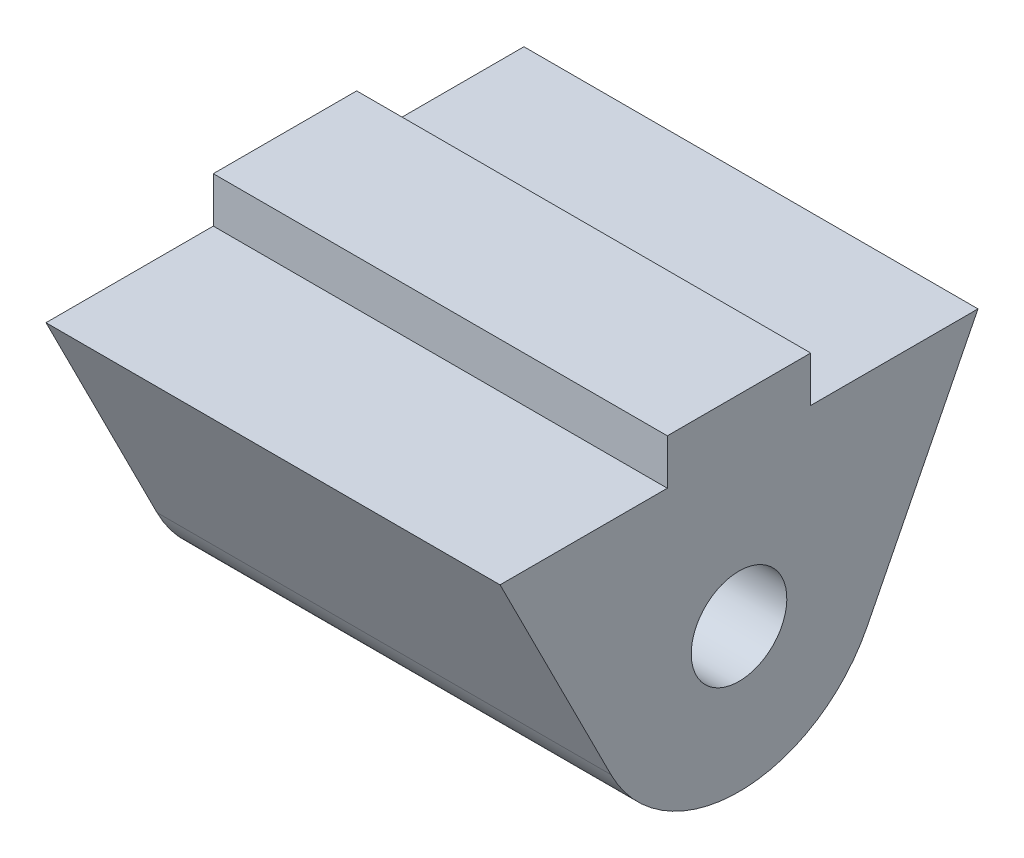
ISO-10303-21;
HEADER;
FILE_DESCRIPTION(('STEP AP214'),'2;1');
FILE_NAME('part.step','',(''),(''),'','','');
FILE_SCHEMA(('AUTOMOTIVE_DESIGN { 1 0 10303 214 1 1 1 1 }'));
ENDSEC;
DATA;
#1=APPLICATION_CONTEXT('core data for automotive mechanical design processes');
#2=APPLICATION_PROTOCOL_DEFINITION('international standard','automotive_design',2000,#1);
#3=PRODUCT_CONTEXT('',#1,'mechanical');
#4=PRODUCT('Part','Part','',(#3));
#5=PRODUCT_RELATED_PRODUCT_CATEGORY('part','',(#4));
#6=PRODUCT_DEFINITION_FORMATION('','',#4);
#7=PRODUCT_DEFINITION_CONTEXT('part definition',#1,'design');
#8=PRODUCT_DEFINITION('design','',#6,#7);
#9=PRODUCT_DEFINITION_SHAPE('','',#8);
#10=(LENGTH_UNIT() NAMED_UNIT(*) SI_UNIT(.MILLI.,.METRE.));
#11=(NAMED_UNIT(*) PLANE_ANGLE_UNIT() SI_UNIT($,.RADIAN.));
#12=(NAMED_UNIT(*) SI_UNIT($,.STERADIAN.) SOLID_ANGLE_UNIT());
#13=UNCERTAINTY_MEASURE_WITH_UNIT(LENGTH_MEASURE(1.E-05),#10,'distance_accuracy_value','');
#14=(GEOMETRIC_REPRESENTATION_CONTEXT(3) GLOBAL_UNCERTAINTY_ASSIGNED_CONTEXT((#13)) GLOBAL_UNIT_ASSIGNED_CONTEXT((#10,
#11,#12)) REPRESENTATION_CONTEXT('',''));
#15=CARTESIAN_POINT('',(0.,0.,0.));
#16=DIRECTION('',(0.,0.,1.));
#17=DIRECTION('',(1.,0.,0.));
#18=AXIS2_PLACEMENT_3D('',#15,#16,#17);
#19=CARTESIAN_POINT('',(0.,6.5,0.));
#20=DIRECTION('',(0.,-1.,0.));
#21=DIRECTION('',(0.,0.,-1.));
#22=AXIS2_PLACEMENT_3D('',#19,#20,#21);
#23=PLANE('',#22);
#24=DIRECTION('',(1.,0.,0.));
#25=VECTOR('',#24,1.);
#26=CARTESIAN_POINT('',(-9.5,6.5,3.));
#27=LINE('',#26,#25);
#28=CARTESIAN_POINT('',(-9.5,6.5,3.));
#29=VERTEX_POINT('',#28);
#30=CARTESIAN_POINT('',(9.5,6.5,3.));
#31=VERTEX_POINT('',#30);
#32=EDGE_CURVE('E61',#29,#31,#27,.T.);
#33=ORIENTED_EDGE('',*,*,#32,.F.);
#34=DIRECTION('',(0.,0.,-1.));
#35=VECTOR('',#34,1.);
#36=CARTESIAN_POINT('',(-9.5,6.5,0.));
#37=LINE('',#36,#35);
#38=CARTESIAN_POINT('',(-9.5,6.5,10.));
#39=VERTEX_POINT('',#38);
#40=EDGE_CURVE('E116',#39,#29,#37,.T.);
#41=ORIENTED_EDGE('',*,*,#40,.F.);
#42=DIRECTION('',(1.,0.,0.));
#43=VECTOR('',#42,1.);
#44=CARTESIAN_POINT('',(-33.0849528301415,6.5,10.));
#45=LINE('',#44,#43);
#46=CARTESIAN_POINT('',(9.5,6.5,10.));
#47=VERTEX_POINT('',#46);
#48=EDGE_CURVE('E162',#39,#47,#45,.T.);
#49=ORIENTED_EDGE('',*,*,#48,.T.);
#50=DIRECTION('',(0.,0.,-1.));
#51=VECTOR('',#50,1.);
#52=CARTESIAN_POINT('',(9.5,6.5,0.));
#53=LINE('',#52,#51);
#54=EDGE_CURVE('E48',#47,#31,#53,.T.);
#55=ORIENTED_EDGE('',*,*,#54,.T.);
#56=EDGE_LOOP('',(#33,#41,#49,#55));
#57=FACE_BOUND('',#56,.T.);
#58=ADVANCED_FACE('F45',(#57),#23,.F.);
#59=DIRECTION('',(-1.,0.,0.));
#60=VECTOR('',#59,1.);
#61=CARTESIAN_POINT('',(-9.5,6.5,-3.));
#62=LINE('',#61,#60);
#63=CARTESIAN_POINT('',(9.5,6.5,-3.));
#64=VERTEX_POINT('',#63);
#65=CARTESIAN_POINT('',(-9.5,6.5,-3.));
#66=VERTEX_POINT('',#65);
#67=EDGE_CURVE('E69',#64,#66,#62,.T.);
#68=ORIENTED_EDGE('',*,*,#67,.F.);
#69=CARTESIAN_POINT('',(9.5,6.5,-9.99999999999999));
#70=VERTEX_POINT('',#69);
#71=EDGE_CURVE('E143',#64,#70,#53,.T.);
#72=ORIENTED_EDGE('',*,*,#71,.T.);
#73=DIRECTION('',(1.,0.,0.));
#74=VECTOR('',#73,1.);
#75=CARTESIAN_POINT('',(-33.0849528301415,6.5,-10.));
#76=LINE('',#75,#74);
#77=CARTESIAN_POINT('',(-9.5,6.5,-10.));
#78=VERTEX_POINT('',#77);
#79=EDGE_CURVE('E112',#78,#70,#76,.T.);
#80=ORIENTED_EDGE('',*,*,#79,.F.);
#81=EDGE_CURVE('E109',#66,#78,#37,.T.);
#82=ORIENTED_EDGE('',*,*,#81,.F.);
#83=EDGE_LOOP('',(#68,#72,#80,#82));
#84=FACE_BOUND('',#83,.T.);
#85=ADVANCED_FACE('F110',(#84),#23,.F.);
#86=CARTESIAN_POINT('',(-33.0849528301415,-2.70274758413108,-5.3567859296856));
#87=DIRECTION('',(0.,-0.450457930688488,-0.892797654947551));
#88=DIRECTION('',(0.,0.892797654947551,-0.450457930688488));
#89=AXIS2_PLACEMENT_3D('',#86,#87,#88);
#90=PLANE('',#89);
#91=DIRECTION('',(1.,0.,0.));
#92=VECTOR('',#91,1.);
#93=CARTESIAN_POINT('',(-33.0849528301415,-2.70274758413071,-5.3567859296856));
#94=LINE('',#93,#92);
#95=CARTESIAN_POINT('',(-9.5,-2.70274758413079,-5.35678592968575));
#96=VERTEX_POINT('',#95);
#97=CARTESIAN_POINT('',(9.5,-2.70274758413079,-5.35678592968575));
#98=VERTEX_POINT('',#97);
#99=EDGE_CURVE('E155',#96,#98,#94,.T.);
#100=ORIENTED_EDGE('',*,*,#99,.F.);
#101=DIRECTION('',(0.,0.892797654947551,-0.450457930688488));
#102=VECTOR('',#101,1.);
#103=CARTESIAN_POINT('',(-9.5,-2.70274758413108,-5.3567859296856));
#104=LINE('',#103,#102);
#105=EDGE_CURVE('E151',#96,#78,#104,.T.);
#106=ORIENTED_EDGE('',*,*,#105,.T.);
#107=ORIENTED_EDGE('',*,*,#79,.T.);
#108=DIRECTION('',(0.,0.892797654947551,-0.450457930688488));
#109=VECTOR('',#108,1.);
#110=CARTESIAN_POINT('',(9.5,-2.70274758413108,-5.3567859296856));
#111=LINE('',#110,#109);
#112=EDGE_CURVE('E11',#98,#70,#111,.T.);
#113=ORIENTED_EDGE('',*,*,#112,.F.);
#114=EDGE_LOOP('',(#100,#106,#107,#113));
#115=FACE_BOUND('',#114,.T.);
#116=ADVANCED_FACE('F181',(#115),#90,.T.);
#117=CARTESIAN_POINT('',(-33.0849528301415,0.,0.));
#118=DIRECTION('',(1.,0.,0.));
#119=DIRECTION('',(0.,0.,-1.));
#120=AXIS2_PLACEMENT_3D('',#117,#118,#119);
#121=CYLINDRICAL_SURFACE('',#120,6.);
#122=DIRECTION('',(1.,0.,0.));
#123=VECTOR('',#122,1.);
#124=CARTESIAN_POINT('',(-33.0849528301415,-2.70274758413096,5.35678592968528));
#125=LINE('',#124,#123);
#126=CARTESIAN_POINT('',(-9.5,-2.70274758413096,5.35678592968528));
#127=VERTEX_POINT('',#126);
#128=CARTESIAN_POINT('',(9.5,-2.70274758413096,5.35678592968528));
#129=VERTEX_POINT('',#128);
#130=EDGE_CURVE('E153',#127,#129,#125,.T.);
#131=ORIENTED_EDGE('',*,*,#130,.F.);
#132=CARTESIAN_POINT('',(-9.5,0.,0.));
#133=DIRECTION('',(-1.,0.,0.));
#134=DIRECTION('',(0.,-1.,0.));
#135=AXIS2_PLACEMENT_3D('',#132,#133,#134);
#136=CIRCLE('',#135,6.);
#137=EDGE_CURVE('E157',#127,#96,#136,.F.);
#138=ORIENTED_EDGE('',*,*,#137,.T.);
#139=ORIENTED_EDGE('',*,*,#99,.T.);
#140=CARTESIAN_POINT('',(9.5,0.,0.));
#141=DIRECTION('',(1.,0.,0.));
#142=DIRECTION('',(0.,1.,0.));
#143=AXIS2_PLACEMENT_3D('',#140,#141,#142);
#144=CIRCLE('',#143,6.);
#145=EDGE_CURVE('E53',#129,#98,#144,.T.);
#146=ORIENTED_EDGE('',*,*,#145,.F.);
#147=EDGE_LOOP('',(#131,#138,#139,#146));
#148=FACE_BOUND('',#147,.T.);
#149=ADVANCED_FACE('F187',(#148),#121,.T.);
#150=CARTESIAN_POINT('',(-33.0849528301415,-2.7027475841311,5.35678592968521));
#151=DIRECTION('',(0.,0.450457930688517,-0.892797654947536));
#152=DIRECTION('',(0.,0.892797654947536,0.450457930688517));
#153=AXIS2_PLACEMENT_3D('',#150,#151,#152);
#154=PLANE('',#153);
#155=DIRECTION('',(0.,0.892797654947536,0.450457930688517));
#156=VECTOR('',#155,1.);
#157=CARTESIAN_POINT('',(-9.5,-2.7027475841311,5.35678592968521));
#158=LINE('',#157,#156);
#159=EDGE_CURVE('E117',#127,#39,#158,.T.);
#160=ORIENTED_EDGE('',*,*,#159,.F.);
#161=ORIENTED_EDGE('',*,*,#130,.T.);
#162=DIRECTION('',(0.,0.892797654947536,0.450457930688517));
#163=VECTOR('',#162,1.);
#164=CARTESIAN_POINT('',(9.5,-2.7027475841311,5.35678592968521));
#165=LINE('',#164,#163);
#166=EDGE_CURVE('E167',#129,#47,#165,.T.);
#167=ORIENTED_EDGE('',*,*,#166,.T.);
#168=ORIENTED_EDGE('',*,*,#48,.F.);
#169=EDGE_LOOP('',(#160,#161,#167,#168));
#170=FACE_BOUND('',#169,.T.);
#171=ADVANCED_FACE('F190',(#170),#154,.F.);
#172=CARTESIAN_POINT('',(-33.0849528301415,0.,0.));
#173=DIRECTION('',(1.,0.,0.));
#174=DIRECTION('',(0.,0.,-1.));
#175=AXIS2_PLACEMENT_3D('',#172,#173,#174);
#176=CYLINDRICAL_SURFACE('',#175,2.);
#177=CARTESIAN_POINT('',(-9.5,0.,0.));
#178=DIRECTION('',(-1.,0.,0.));
#179=DIRECTION('',(0.,-1.,0.));
#180=AXIS2_PLACEMENT_3D('',#177,#178,#179);
#181=CIRCLE('',#180,2.);
#182=CARTESIAN_POINT('',(-9.5,-2.,0.));
#183=VERTEX_POINT('',#182);
#184=EDGE_CURVE('E154',#183,#183,#181,.F.);
#185=ORIENTED_EDGE('',*,*,#184,.F.);
#186=EDGE_LOOP('',(#185));
#187=FACE_BOUND('',#186,.T.);
#188=CARTESIAN_POINT('',(9.5,0.,0.));
#189=DIRECTION('',(1.,0.,0.));
#190=DIRECTION('',(0.,1.,0.));
#191=AXIS2_PLACEMENT_3D('',#188,#189,#190);
#192=CIRCLE('',#191,2.);
#193=CARTESIAN_POINT('',(9.5,2.,0.));
#194=VERTEX_POINT('',#193);
#195=EDGE_CURVE('E170',#194,#194,#192,.T.);
#196=ORIENTED_EDGE('',*,*,#195,.T.);
#197=EDGE_LOOP('',(#196));
#198=FACE_BOUND('',#197,.T.);
#199=ADVANCED_FACE('F192',(#187,#198),#176,.F.);
#200=CARTESIAN_POINT('',(9.5,-139.999817401926,-0.226113748918073));
#201=DIRECTION('',(1.,0.,0.));
#202=DIRECTION('',(0.,0.00161509820655725,-0.999998695728041));
#203=AXIS2_PLACEMENT_3D('',#200,#201,#202);
#204=PLANE('',#203);
#205=ORIENTED_EDGE('',*,*,#195,.F.);
#206=EDGE_LOOP('',(#205));
#207=FACE_BOUND('',#206,.T.);
#208=ORIENTED_EDGE('',*,*,#166,.F.);
#209=ORIENTED_EDGE('',*,*,#145,.T.);
#210=ORIENTED_EDGE('',*,*,#112,.T.);
#211=ORIENTED_EDGE('',*,*,#71,.F.);
#212=DIRECTION('',(0.,-1.,0.));
#213=VECTOR('',#212,1.);
#214=CARTESIAN_POINT('',(9.5,8.4,-3.));
#215=LINE('',#214,#213);
#216=CARTESIAN_POINT('',(9.5,8.4,-3.));
#217=VERTEX_POINT('',#216);
#218=EDGE_CURVE('E127',#217,#64,#215,.T.);
#219=ORIENTED_EDGE('',*,*,#218,.F.);
#220=DIRECTION('',(0.,0.,-1.));
#221=VECTOR('',#220,1.);
#222=CARTESIAN_POINT('',(9.5,8.4,3.));
#223=LINE('',#222,#221);
#224=CARTESIAN_POINT('',(9.5,8.4,3.));
#225=VERTEX_POINT('',#224);
#226=EDGE_CURVE('E147',#225,#217,#223,.T.);
#227=ORIENTED_EDGE('',*,*,#226,.F.);
#228=DIRECTION('',(0.,-1.,0.));
#229=VECTOR('',#228,1.);
#230=CARTESIAN_POINT('',(9.5,8.4,3.));
#231=LINE('',#230,#229);
#232=EDGE_CURVE('E138',#225,#31,#231,.T.);
#233=ORIENTED_EDGE('',*,*,#232,.T.);
#234=ORIENTED_EDGE('',*,*,#54,.F.);
#235=EDGE_LOOP('',(#208,#209,#210,#211,#219,#227,#233,#234));
#236=FACE_BOUND('',#235,.T.);
#237=ADVANCED_FACE('F183',(#207,#236),#204,.T.);
#238=CARTESIAN_POINT('',(-9.5,-139.999817401926,-0.226113748918073));
#239=DIRECTION('',(-1.,0.,0.));
#240=DIRECTION('',(0.,0.00161509820655725,-0.999998695728041));
#241=AXIS2_PLACEMENT_3D('',#238,#239,#240);
#242=PLANE('',#241);
#243=ORIENTED_EDGE('',*,*,#137,.F.);
#244=ORIENTED_EDGE('',*,*,#159,.T.);
#245=ORIENTED_EDGE('',*,*,#40,.T.);
#246=DIRECTION('',(0.,-1.,0.));
#247=VECTOR('',#246,1.);
#248=CARTESIAN_POINT('',(-9.5,8.4,3.));
#249=LINE('',#248,#247);
#250=CARTESIAN_POINT('',(-9.5,8.4,3.));
#251=VERTEX_POINT('',#250);
#252=EDGE_CURVE('E134',#251,#29,#249,.T.);
#253=ORIENTED_EDGE('',*,*,#252,.F.);
#254=DIRECTION('',(0.,0.,1.));
#255=VECTOR('',#254,1.);
#256=CARTESIAN_POINT('',(-9.5,8.4,3.));
#257=LINE('',#256,#255);
#258=CARTESIAN_POINT('',(-9.5,8.4,-3.));
#259=VERTEX_POINT('',#258);
#260=EDGE_CURVE('E133',#259,#251,#257,.T.);
#261=ORIENTED_EDGE('',*,*,#260,.F.);
#262=DIRECTION('',(0.,-1.,0.));
#263=VECTOR('',#262,1.);
#264=CARTESIAN_POINT('',(-9.5,8.4,-3.));
#265=LINE('',#264,#263);
#266=EDGE_CURVE('E124',#259,#66,#265,.T.);
#267=ORIENTED_EDGE('',*,*,#266,.T.);
#268=ORIENTED_EDGE('',*,*,#81,.T.);
#269=ORIENTED_EDGE('',*,*,#105,.F.);
#270=EDGE_LOOP('',(#243,#244,#245,#253,#261,#267,#268,#269));
#271=FACE_BOUND('',#270,.T.);
#272=ORIENTED_EDGE('',*,*,#184,.T.);
#273=EDGE_LOOP('',(#272));
#274=FACE_BOUND('',#273,.T.);
#275=ADVANCED_FACE('F130',(#271,#274),#242,.T.);
#276=CARTESIAN_POINT('',(-9.5,8.4,3.));
#277=DIRECTION('',(0.,0.,-1.));
#278=DIRECTION('',(-1.,0.,0.));
#279=AXIS2_PLACEMENT_3D('',#276,#277,#278);
#280=PLANE('',#279);
#281=ORIENTED_EDGE('',*,*,#32,.T.);
#282=ORIENTED_EDGE('',*,*,#232,.F.);
#283=DIRECTION('',(1.,0.,0.));
#284=VECTOR('',#283,1.);
#285=CARTESIAN_POINT('',(-9.5,8.4,3.));
#286=LINE('',#285,#284);
#287=EDGE_CURVE('E128',#251,#225,#286,.T.);
#288=ORIENTED_EDGE('',*,*,#287,.F.);
#289=ORIENTED_EDGE('',*,*,#252,.T.);
#290=EDGE_LOOP('',(#281,#282,#288,#289));
#291=FACE_BOUND('',#290,.T.);
#292=ADVANCED_FACE('F213',(#291),#280,.F.);
#293=CARTESIAN_POINT('',(-9.5,8.4,-3.));
#294=DIRECTION('',(0.,0.,1.));
#295=DIRECTION('',(1.,0.,0.));
#296=AXIS2_PLACEMENT_3D('',#293,#294,#295);
#297=PLANE('',#296);
#298=ORIENTED_EDGE('',*,*,#67,.T.);
#299=ORIENTED_EDGE('',*,*,#266,.F.);
#300=DIRECTION('',(-1.,0.,0.));
#301=VECTOR('',#300,1.);
#302=CARTESIAN_POINT('',(-9.5,8.4,-3.));
#303=LINE('',#302,#301);
#304=EDGE_CURVE('E145',#217,#259,#303,.T.);
#305=ORIENTED_EDGE('',*,*,#304,.F.);
#306=ORIENTED_EDGE('',*,*,#218,.T.);
#307=EDGE_LOOP('',(#298,#299,#305,#306));
#308=FACE_BOUND('',#307,.T.);
#309=ADVANCED_FACE('F122',(#308),#297,.F.);
#310=CARTESIAN_POINT('',(0.,8.4,0.));
#311=DIRECTION('',(0.,1.,0.));
#312=DIRECTION('',(0.,0.,1.));
#313=AXIS2_PLACEMENT_3D('',#310,#311,#312);
#314=PLANE('',#313);
#315=ORIENTED_EDGE('',*,*,#287,.T.);
#316=ORIENTED_EDGE('',*,*,#226,.T.);
#317=ORIENTED_EDGE('',*,*,#304,.T.);
#318=ORIENTED_EDGE('',*,*,#260,.T.);
#319=EDGE_LOOP('',(#315,#316,#317,#318));
#320=FACE_BOUND('',#319,.T.);
#321=ADVANCED_FACE('F255',(#320),#314,.T.);
#322=CLOSED_SHELL('',(#58,#85,#116,#149,#171,#199,#237,#275,#292,#309,#321));
#323=MANIFOLD_SOLID_BREP('B2',#322);
#324=ADVANCED_BREP_SHAPE_REPRESENTATION('',(#18,#323),#14);
#325=SHAPE_DEFINITION_REPRESENTATION(#9,#324);
ENDSEC;
END-ISO-10303-21;
